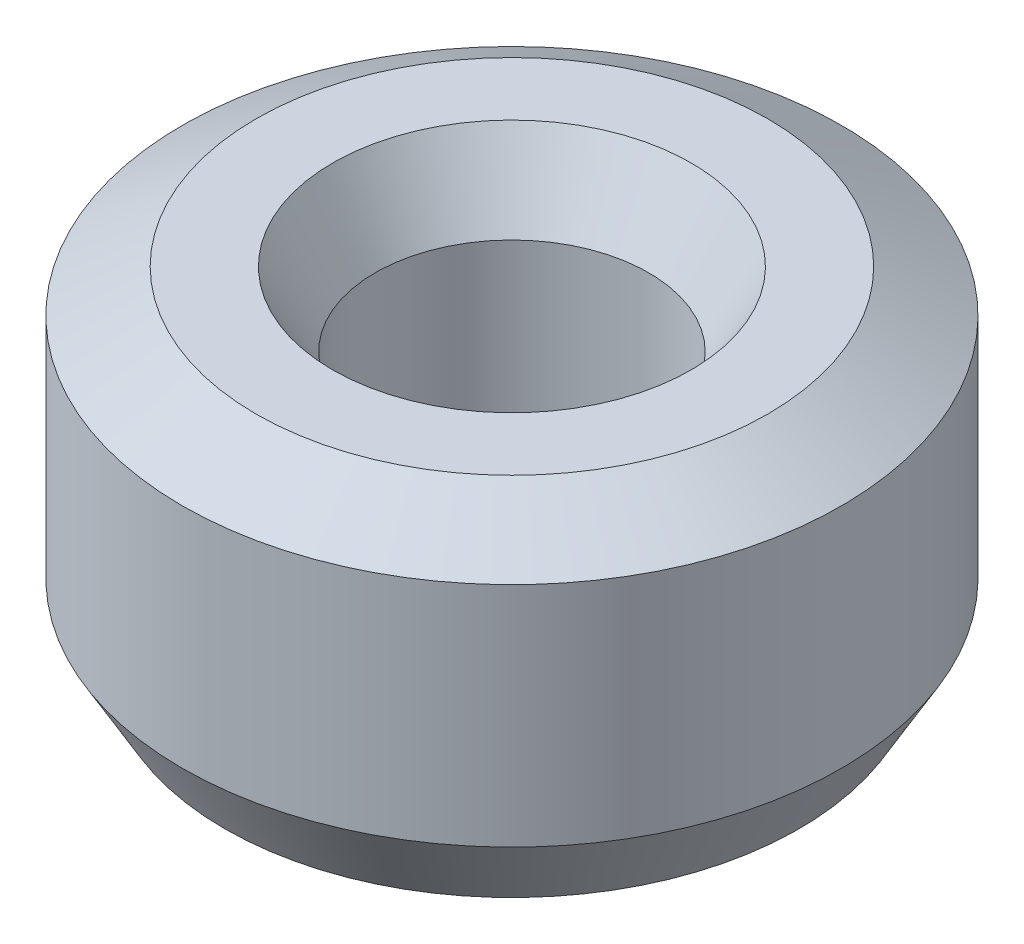
ISO-10303-21;
HEADER;
FILE_DESCRIPTION(('STEP AP214'),'2;1');
FILE_NAME('part.step','',(''),(''),'','','');
FILE_SCHEMA(('AUTOMOTIVE_DESIGN { 1 0 10303 214 1 1 1 1 }'));
ENDSEC;
DATA;
#1=APPLICATION_CONTEXT('core data for automotive mechanical design processes');
#2=APPLICATION_PROTOCOL_DEFINITION('international standard','automotive_design',2000,#1);
#3=PRODUCT_CONTEXT('',#1,'mechanical');
#4=PRODUCT('Part','Part','',(#3));
#5=PRODUCT_RELATED_PRODUCT_CATEGORY('part','',(#4));
#6=PRODUCT_DEFINITION_FORMATION('','',#4);
#7=PRODUCT_DEFINITION_CONTEXT('part definition',#1,'design');
#8=PRODUCT_DEFINITION('design','',#6,#7);
#9=PRODUCT_DEFINITION_SHAPE('','',#8);
#10=(LENGTH_UNIT() NAMED_UNIT(*) SI_UNIT(.MILLI.,.METRE.));
#11=(NAMED_UNIT(*) PLANE_ANGLE_UNIT() SI_UNIT($,.RADIAN.));
#12=(NAMED_UNIT(*) SI_UNIT($,.STERADIAN.) SOLID_ANGLE_UNIT());
#13=UNCERTAINTY_MEASURE_WITH_UNIT(LENGTH_MEASURE(1.E-05),#10,'distance_accuracy_value','');
#14=(GEOMETRIC_REPRESENTATION_CONTEXT(3) GLOBAL_UNCERTAINTY_ASSIGNED_CONTEXT((#13)) GLOBAL_UNIT_ASSIGNED_CONTEXT((#10,
#11,#12)) REPRESENTATION_CONTEXT('',''));
#15=CARTESIAN_POINT('',(0.,0.,0.));
#16=DIRECTION('',(0.,0.,1.));
#17=DIRECTION('',(1.,0.,0.));
#18=AXIS2_PLACEMENT_3D('',#15,#16,#17);
#19=CARTESIAN_POINT('',(0.,23.4626521254849,0.));
#20=DIRECTION('',(0.,-1.,0.));
#21=DIRECTION('',(0.,0.,-1.));
#22=AXIS2_PLACEMENT_3D('',#19,#20,#21);
#23=CYLINDRICAL_SURFACE('',#22,22.5);
#24=CARTESIAN_POINT('',(0.,5.03544416569933,0.));
#25=DIRECTION('',(0.,1.,0.));
#26=DIRECTION('',(0.,0.,1.));
#27=AXIS2_PLACEMENT_3D('',#24,#25,#26);
#28=CIRCLE('',#27,22.5);
#29=CARTESIAN_POINT('',(0.,5.03544416569933,22.5));
#30=VERTEX_POINT('',#29);
#31=EDGE_CURVE('E10',#30,#30,#28,.T.);
#32=ORIENTED_EDGE('',*,*,#31,.T.);
#33=EDGE_LOOP('',(#32));
#34=FACE_BOUND('',#33,.T.);
#35=CARTESIAN_POINT('',(0.,20.555437080929,0.));
#36=DIRECTION('',(0.,1.,0.));
#37=DIRECTION('',(0.,0.,1.));
#38=AXIS2_PLACEMENT_3D('',#35,#36,#37);
#39=CIRCLE('',#38,22.5);
#40=CARTESIAN_POINT('',(0.,20.555437080929,22.5));
#41=VERTEX_POINT('',#40);
#42=EDGE_CURVE('E50',#41,#41,#39,.F.);
#43=ORIENTED_EDGE('',*,*,#42,.T.);
#44=EDGE_LOOP('',(#43));
#45=FACE_BOUND('',#44,.T.);
#46=ADVANCED_FACE('F39',(#34,#45),#23,.T.);
#47=CARTESIAN_POINT('',(0.,23.4626521254849,0.));
#48=DIRECTION('',(0.,1.,0.));
#49=DIRECTION('',(0.,0.,1.));
#50=AXIS2_PLACEMENT_3D('',#47,#48,#49);
#51=PLANE('',#50);
#52=CARTESIAN_POINT('',(0.,23.4626521254849,0.));
#53=DIRECTION('',(0.,1.,0.));
#54=DIRECTION('',(0.,0.,1.));
#55=AXIS2_PLACEMENT_3D('',#52,#53,#54);
#56=CIRCLE('',#55,12.2388486131341);
#57=CARTESIAN_POINT('',(0.,23.4626521254849,12.2388486131341));
#58=VERTEX_POINT('',#57);
#59=EDGE_CURVE('E58',#58,#58,#56,.F.);
#60=ORIENTED_EDGE('',*,*,#59,.T.);
#61=EDGE_LOOP('',(#60));
#62=FACE_BOUND('',#61,.T.);
#63=CARTESIAN_POINT('',(0.,23.4626521254849,0.));
#64=DIRECTION('',(0.,1.,0.));
#65=DIRECTION('',(0.,0.,1.));
#66=AXIS2_PLACEMENT_3D('',#63,#64,#65);
#67=CIRCLE('',#66,17.4645558343007);
#68=CARTESIAN_POINT('',(0.,23.4626521254849,17.4645558343007));
#69=VERTEX_POINT('',#68);
#70=EDGE_CURVE('E61',#69,#69,#67,.T.);
#71=ORIENTED_EDGE('',*,*,#70,.T.);
#72=EDGE_LOOP('',(#71));
#73=FACE_BOUND('',#72,.T.);
#74=ADVANCED_FACE('F88',(#62,#73),#51,.T.);
#75=CARTESIAN_POINT('',(0.,0.,0.));
#76=DIRECTION('',(0.,1.,0.));
#77=DIRECTION('',(0.,0.,1.));
#78=AXIS2_PLACEMENT_3D('',#75,#76,#77);
#79=PLANE('',#78);
#80=CARTESIAN_POINT('',(0.,0.,0.));
#81=DIRECTION('',(0.,1.,0.));
#82=DIRECTION('',(0.,0.,1.));
#83=AXIS2_PLACEMENT_3D('',#80,#81,#82);
#84=CIRCLE('',#83,14.3670777342776);
#85=CARTESIAN_POINT('',(0.,0.,14.3670777342776));
#86=VERTEX_POINT('',#85);
#87=EDGE_CURVE('E51',#86,#86,#84,.T.);
#88=ORIENTED_EDGE('',*,*,#87,.T.);
#89=EDGE_LOOP('',(#88));
#90=FACE_BOUND('',#89,.T.);
#91=CARTESIAN_POINT('',(0.,0.,0.));
#92=DIRECTION('',(0.,1.,0.));
#93=DIRECTION('',(0.,0.,1.));
#94=AXIS2_PLACEMENT_3D('',#91,#92,#93);
#95=CIRCLE('',#94,19.5927849554441);
#96=CARTESIAN_POINT('',(0.,0.,19.5927849554441));
#97=VERTEX_POINT('',#96);
#98=EDGE_CURVE('E54',#97,#97,#95,.F.);
#99=ORIENTED_EDGE('',*,*,#98,.T.);
#100=EDGE_LOOP('',(#99));
#101=FACE_BOUND('',#100,.T.);
#102=ADVANCED_FACE('F83',(#90,#101),#79,.F.);
#103=CARTESIAN_POINT('',(0.,23.4626521254849,0.));
#104=DIRECTION('',(0.,-1.,0.));
#105=DIRECTION('',(0.,0.,-1.));
#106=AXIS2_PLACEMENT_3D('',#103,#104,#105);
#107=CYLINDRICAL_SURFACE('',#106,9.33163356857827);
#108=CARTESIAN_POINT('',(0.,18.4272079597856,0.));
#109=DIRECTION('',(0.,1.,0.));
#110=DIRECTION('',(0.,0.,1.));
#111=AXIS2_PLACEMENT_3D('',#108,#109,#110);
#112=CIRCLE('',#111,9.33163356857827);
#113=CARTESIAN_POINT('',(0.,18.4272079597856,9.33163356857827));
#114=VERTEX_POINT('',#113);
#115=EDGE_CURVE('E67',#114,#114,#112,.T.);
#116=ORIENTED_EDGE('',*,*,#115,.T.);
#117=EDGE_LOOP('',(#116));
#118=FACE_BOUND('',#117,.T.);
#119=CARTESIAN_POINT('',(0.,2.90721504455586,0.));
#120=DIRECTION('',(0.,1.,0.));
#121=DIRECTION('',(0.,0.,1.));
#122=AXIS2_PLACEMENT_3D('',#119,#120,#121);
#123=CIRCLE('',#122,9.33163356857827);
#124=CARTESIAN_POINT('',(0.,2.90721504455586,9.33163356857827));
#125=VERTEX_POINT('',#124);
#126=EDGE_CURVE('E69',#125,#125,#123,.F.);
#127=ORIENTED_EDGE('',*,*,#126,.T.);
#128=EDGE_LOOP('',(#127));
#129=FACE_BOUND('',#128,.T.);
#130=ADVANCED_FACE('F71',(#118,#129),#107,.F.);
#131=CARTESIAN_POINT('',(0.,18.4272079597856,0.));
#132=DIRECTION('',(0.,1.,0.));
#133=DIRECTION('',(0.,0.,1.));
#134=AXIS2_PLACEMENT_3D('',#131,#132,#133);
#135=CONICAL_SURFACE('',#134,9.33163356857827,0.523598775598304);
#136=ORIENTED_EDGE('',*,*,#59,.F.);
#137=EDGE_LOOP('',(#136));
#138=FACE_BOUND('',#137,.T.);
#139=ORIENTED_EDGE('',*,*,#115,.F.);
#140=EDGE_LOOP('',(#139));
#141=FACE_BOUND('',#140,.T.);
#142=ADVANCED_FACE('F77',(#138,#141),#135,.F.);
#143=CARTESIAN_POINT('',(0.,0.,0.));
#144=DIRECTION('',(0.,-1.,0.));
#145=DIRECTION('',(0.,0.,-1.));
#146=AXIS2_PLACEMENT_3D('',#143,#144,#145);
#147=CONICAL_SURFACE('',#146,14.3670777342776,1.04719755119659);
#148=ORIENTED_EDGE('',*,*,#126,.F.);
#149=EDGE_LOOP('',(#148));
#150=FACE_BOUND('',#149,.T.);
#151=ORIENTED_EDGE('',*,*,#87,.F.);
#152=EDGE_LOOP('',(#151));
#153=FACE_BOUND('',#152,.T.);
#154=ADVANCED_FACE('F73',(#150,#153),#147,.F.);
#155=CARTESIAN_POINT('',(0.,5.03544416569933,0.));
#156=DIRECTION('',(0.,1.,0.));
#157=DIRECTION('',(0.,0.,1.));
#158=AXIS2_PLACEMENT_3D('',#155,#156,#157);
#159=CONICAL_SURFACE('',#158,22.5,0.523598775598303);
#160=ORIENTED_EDGE('',*,*,#98,.F.);
#161=EDGE_LOOP('',(#160));
#162=FACE_BOUND('',#161,.T.);
#163=ORIENTED_EDGE('',*,*,#31,.F.);
#164=EDGE_LOOP('',(#163));
#165=FACE_BOUND('',#164,.T.);
#166=ADVANCED_FACE('F76',(#162,#165),#159,.T.);
#167=CARTESIAN_POINT('',(0.,23.4626521254849,0.));
#168=DIRECTION('',(0.,-1.,0.));
#169=DIRECTION('',(0.,0.,-1.));
#170=AXIS2_PLACEMENT_3D('',#167,#168,#169);
#171=CONICAL_SURFACE('',#170,17.4645558343007,1.04719755119659);
#172=ORIENTED_EDGE('',*,*,#42,.F.);
#173=EDGE_LOOP('',(#172));
#174=FACE_BOUND('',#173,.T.);
#175=ORIENTED_EDGE('',*,*,#70,.F.);
#176=EDGE_LOOP('',(#175));
#177=FACE_BOUND('',#176,.T.);
#178=ADVANCED_FACE('F45',(#174,#177),#171,.T.);
#179=CLOSED_SHELL('',(#46,#74,#102,#130,#142,#154,#166,#178));
#180=MANIFOLD_SOLID_BREP('B2',#179);
#181=ADVANCED_BREP_SHAPE_REPRESENTATION('',(#18,#180),#14);
#182=SHAPE_DEFINITION_REPRESENTATION(#9,#181);
ENDSEC;
END-ISO-10303-21;
